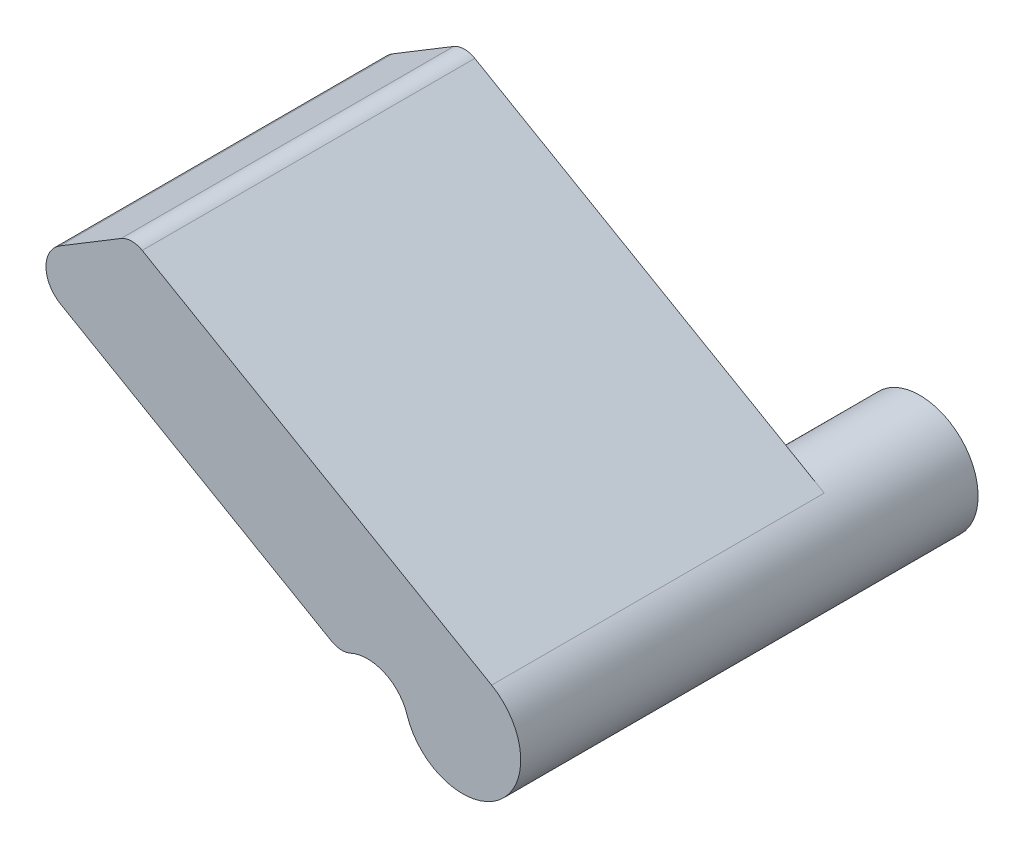
ISO-10303-21;
HEADER;
FILE_DESCRIPTION(('STEP AP214'),'2;1');
FILE_NAME('part.step','',(''),(''),'','','');
FILE_SCHEMA(('AUTOMOTIVE_DESIGN { 1 0 10303 214 1 1 1 1 }'));
ENDSEC;
DATA;
#1=APPLICATION_CONTEXT('core data for automotive mechanical design processes');
#2=APPLICATION_PROTOCOL_DEFINITION('international standard','automotive_design',2000,#1);
#3=PRODUCT_CONTEXT('',#1,'mechanical');
#4=PRODUCT('Part','Part','',(#3));
#5=PRODUCT_RELATED_PRODUCT_CATEGORY('part','',(#4));
#6=PRODUCT_DEFINITION_FORMATION('','',#4);
#7=PRODUCT_DEFINITION_CONTEXT('part definition',#1,'design');
#8=PRODUCT_DEFINITION('design','',#6,#7);
#9=PRODUCT_DEFINITION_SHAPE('','',#8);
#10=(LENGTH_UNIT() NAMED_UNIT(*) SI_UNIT(.MILLI.,.METRE.));
#11=(NAMED_UNIT(*) PLANE_ANGLE_UNIT() SI_UNIT($,.RADIAN.));
#12=(NAMED_UNIT(*) SI_UNIT($,.STERADIAN.) SOLID_ANGLE_UNIT());
#13=UNCERTAINTY_MEASURE_WITH_UNIT(LENGTH_MEASURE(1.E-05),#10,'distance_accuracy_value','');
#14=(GEOMETRIC_REPRESENTATION_CONTEXT(3) GLOBAL_UNCERTAINTY_ASSIGNED_CONTEXT((#13)) GLOBAL_UNIT_ASSIGNED_CONTEXT((#10,
#11,#12)) REPRESENTATION_CONTEXT('',''));
#15=CARTESIAN_POINT('',(0.,0.,0.));
#16=DIRECTION('',(0.,0.,1.));
#17=DIRECTION('',(1.,0.,0.));
#18=AXIS2_PLACEMENT_3D('',#15,#16,#17);
#19=CARTESIAN_POINT('',(-7.96025403784438,6.21243556529823,8.));
#20=DIRECTION('',(0.517785832846385,-0.855510275393333,0.));
#21=DIRECTION('',(0.855510275393333,0.517785832846385,0.));
#22=AXIS2_PLACEMENT_3D('',#19,#20,#21);
#23=PLANE('',#22);
#24=DIRECTION('',(-0.855510275393333,-0.517785832846385,0.));
#25=VECTOR('',#24,1.);
#26=CARTESIAN_POINT('',(-7.96025403784438,6.21243556529823,0.));
#27=LINE('',#26,#25);
#28=CARTESIAN_POINT('',(-8.21314633879446,6.05937597684656,0.));
#29=VERTEX_POINT('',#28);
#30=CARTESIAN_POINT('',(-9.68129055728227,5.17080187227626,0.));
#31=VERTEX_POINT('',#30);
#32=EDGE_CURVE('E167',#29,#31,#27,.T.);
#33=ORIENTED_EDGE('',*,*,#32,.T.);
#34=DIRECTION('',(0.,0.,-1.));
#35=VECTOR('',#34,1.);
#36=CARTESIAN_POINT('',(-9.68129055728227,5.17080187227626,8.));
#37=LINE('',#36,#35);
#38=CARTESIAN_POINT('',(-9.68129055728227,5.17080187227626,8.));
#39=VERTEX_POINT('',#38);
#40=EDGE_CURVE('E52',#31,#39,#37,.F.);
#41=ORIENTED_EDGE('',*,*,#40,.T.);
#42=DIRECTION('',(-0.855510275393333,-0.517785832846385,0.));
#43=VECTOR('',#42,1.);
#44=CARTESIAN_POINT('',(-7.96025403784438,6.21243556529823,8.));
#45=LINE('',#44,#43);
#46=CARTESIAN_POINT('',(-8.21314633879446,6.05937597684656,8.));
#47=VERTEX_POINT('',#46);
#48=EDGE_CURVE('E110',#47,#39,#45,.T.);
#49=ORIENTED_EDGE('',*,*,#48,.F.);
#50=DIRECTION('',(0.,0.,-1.));
#51=VECTOR('',#50,1.);
#52=CARTESIAN_POINT('',(-8.21314633879446,6.05937597684656,8.));
#53=LINE('',#52,#51);
#54=EDGE_CURVE('E130',#47,#29,#53,.T.);
#55=ORIENTED_EDGE('',*,*,#54,.T.);
#56=EDGE_LOOP('',(#33,#41,#49,#55));
#57=FACE_BOUND('',#56,.T.);
#58=ADVANCED_FACE('F35',(#57),#23,.F.);
#59=CARTESIAN_POINT('',(-10.6942286340599,4.55773502691897,8.));
#60=DIRECTION('',(0.500000000000001,0.866025403784438,0.));
#61=DIRECTION('',(-0.866025403784438,0.500000000000001,0.));
#62=AXIS2_PLACEMENT_3D('',#59,#60,#61);
#63=PLANE('',#62);
#64=DIRECTION('',(0.866025403784438,-0.500000000000001,0.));
#65=VECTOR('',#64,1.);
#66=CARTESIAN_POINT('',(-10.6942286340599,4.55773502691897,8.));
#67=LINE('',#66,#65);
#68=CARTESIAN_POINT('',(-9.66884047428981,3.96572689685182,8.));
#69=VERTEX_POINT('',#68);
#70=CARTESIAN_POINT('',(-3.15192630425893,0.203184746498806,8.));
#71=VERTEX_POINT('',#70);
#72=EDGE_CURVE('E174',#69,#71,#67,.T.);
#73=ORIENTED_EDGE('',*,*,#72,.F.);
#74=DIRECTION('',(0.,0.,-1.));
#75=VECTOR('',#74,1.);
#76=CARTESIAN_POINT('',(-9.66884047428981,3.96572689685182,8.));
#77=LINE('',#76,#75);
#78=CARTESIAN_POINT('',(-9.66884047428981,3.96572689685182,0.));
#79=VERTEX_POINT('',#78);
#80=EDGE_CURVE('E148',#69,#79,#77,.T.);
#81=ORIENTED_EDGE('',*,*,#80,.T.);
#82=DIRECTION('',(0.866025403784438,-0.500000000000001,0.));
#83=VECTOR('',#82,1.);
#84=CARTESIAN_POINT('',(-10.6942286340599,4.55773502691897,0.));
#85=LINE('',#84,#83);
#86=CARTESIAN_POINT('',(-3.15192630425893,0.203184746498806,0.));
#87=VERTEX_POINT('',#86);
#88=EDGE_CURVE('E137',#79,#87,#85,.T.);
#89=ORIENTED_EDGE('',*,*,#88,.T.);
#90=DIRECTION('',(0.,0.,-1.));
#91=VECTOR('',#90,1.);
#92=CARTESIAN_POINT('',(-3.15192630425893,0.203184746498806,8.));
#93=LINE('',#92,#91);
#94=EDGE_CURVE('E151',#87,#71,#93,.F.);
#95=ORIENTED_EDGE('',*,*,#94,.T.);
#96=EDGE_LOOP('',(#73,#81,#89,#95));
#97=FACE_BOUND('',#96,.T.);
#98=ADVANCED_FACE('F190',(#97),#63,.F.);
#99=CARTESIAN_POINT('',(-2.2858262526838,-0.731435808900241,8.));
#100=DIRECTION('',(0.,0.,-1.));
#101=DIRECTION('',(-1.,0.,0.));
#102=AXIS2_PLACEMENT_3D('',#99,#100,#101);
#103=CYLINDRICAL_SURFACE('',#102,1.);
#104=CARTESIAN_POINT('',(-2.2858262526838,-0.731435808900241,8.));
#105=DIRECTION('',(0.,0.,-1.));
#106=DIRECTION('',(-1.,0.,0.));
#107=AXIS2_PLACEMENT_3D('',#104,#105,#106);
#108=CIRCLE('',#107,1.);
#109=CARTESIAN_POINT('',(-2.69655962040056,0.180319695960603,8.));
#110=VERTEX_POINT('',#109);
#111=CARTESIAN_POINT('',(-1.33339864739889,-0.426670888525141,8.));
#112=VERTEX_POINT('',#111);
#113=EDGE_CURVE('E172',#110,#112,#108,.T.);
#114=ORIENTED_EDGE('',*,*,#113,.F.);
#115=DIRECTION('',(0.,0.,-1.));
#116=VECTOR('',#115,1.);
#117=CARTESIAN_POINT('',(-2.69655962040056,0.180319695960603,8.));
#118=LINE('',#117,#116);
#119=CARTESIAN_POINT('',(-2.69655962040056,0.180319695960603,0.));
#120=VERTEX_POINT('',#119);
#121=EDGE_CURVE('E154',#110,#120,#118,.T.);
#122=ORIENTED_EDGE('',*,*,#121,.T.);
#123=CARTESIAN_POINT('',(-2.2858262526838,-0.731435808900241,0.));
#124=DIRECTION('',(0.,0.,-1.));
#125=DIRECTION('',(-1.,0.,0.));
#126=AXIS2_PLACEMENT_3D('',#123,#124,#125);
#127=CIRCLE('',#126,1.);
#128=CARTESIAN_POINT('',(-1.33339864739889,-0.426670888525141,0.));
#129=VERTEX_POINT('',#128);
#130=EDGE_CURVE('E111',#120,#129,#127,.T.);
#131=ORIENTED_EDGE('',*,*,#130,.T.);
#132=DIRECTION('',(0.,0.,-1.));
#133=VECTOR('',#132,1.);
#134=CARTESIAN_POINT('',(-1.33339864739889,-0.426670888525141,8.));
#135=LINE('',#134,#133);
#136=EDGE_CURVE('E121',#112,#129,#135,.T.);
#137=ORIENTED_EDGE('',*,*,#136,.F.);
#138=EDGE_LOOP('',(#114,#122,#131,#137));
#139=FACE_BOUND('',#138,.T.);
#140=ADVANCED_FACE('F182',(#139),#103,.F.);
#141=CARTESIAN_POINT('',(0.,0.,8.));
#142=DIRECTION('',(0.,0.,-1.));
#143=DIRECTION('',(-1.,0.,0.));
#144=AXIS2_PLACEMENT_3D('',#141,#142,#143);
#145=CYLINDRICAL_SURFACE('',#144,1.4);
#146=ORIENTED_EDGE('',*,*,#136,.T.);
#147=CARTESIAN_POINT('',(0.,0.,0.));
#148=DIRECTION('',(0.,0.,-1.));
#149=DIRECTION('',(-1.,0.,0.));
#150=AXIS2_PLACEMENT_3D('',#147,#148,#149);
#151=CIRCLE('',#150,1.4);
#152=CARTESIAN_POINT('',(0.700000000000003,1.21243556529822,0.));
#153=VERTEX_POINT('',#152);
#154=EDGE_CURVE('E11',#129,#153,#151,.T.);
#155=ORIENTED_EDGE('',*,*,#154,.T.);
#156=DIRECTION('',(0.,0.,-1.));
#157=VECTOR('',#156,1.);
#158=CARTESIAN_POINT('',(0.700000000000003,1.21243556529822,8.));
#159=LINE('',#158,#157);
#160=CARTESIAN_POINT('',(0.700000000000003,1.21243556529822,8.));
#161=VERTEX_POINT('',#160);
#162=EDGE_CURVE('E115',#161,#153,#159,.T.);
#163=ORIENTED_EDGE('',*,*,#162,.F.);
#164=CARTESIAN_POINT('',(0.,0.,8.));
#165=DIRECTION('',(0.,0.,1.));
#166=DIRECTION('',(1.,0.,0.));
#167=AXIS2_PLACEMENT_3D('',#164,#165,#166);
#168=CIRCLE('',#167,1.4);
#169=EDGE_CURVE('E127',#112,#161,#168,.T.);
#170=ORIENTED_EDGE('',*,*,#169,.F.);
#171=EDGE_LOOP('',(#146,#155,#163,#170));
#172=FACE_BOUND('',#171,.T.);
#173=CARTESIAN_POINT('',(0.,0.,-3.));
#174=DIRECTION('',(0.,0.,-1.));
#175=DIRECTION('',(-1.,0.,0.));
#176=AXIS2_PLACEMENT_3D('',#173,#174,#175);
#177=CIRCLE('',#176,1.4);
#178=CARTESIAN_POINT('',(-1.4,0.,-3.));
#179=VERTEX_POINT('',#178);
#180=EDGE_CURVE('E169',#179,#179,#177,.T.);
#181=ORIENTED_EDGE('',*,*,#180,.F.);
#182=EDGE_LOOP('',(#181));
#183=FACE_BOUND('',#182,.T.);
#184=ADVANCED_FACE('F124',(#172,#183),#145,.T.);
#185=CARTESIAN_POINT('',(0.700000000000003,1.21243556529822,8.));
#186=DIRECTION('',(-0.500000000000001,-0.866025403784438,0.));
#187=DIRECTION('',(0.866025403784438,-0.500000000000001,0.));
#188=AXIS2_PLACEMENT_3D('',#185,#186,#187);
#189=PLANE('',#188);
#190=DIRECTION('',(-0.866025403784438,0.500000000000001,0.));
#191=VECTOR('',#190,1.);
#192=CARTESIAN_POINT('',(0.700000000000003,1.21243556529822,0.));
#193=LINE('',#192,#191);
#194=CARTESIAN_POINT('',(-7.70425342237126,6.06463354104211,0.));
#195=VERTEX_POINT('',#194);
#196=EDGE_CURVE('E102',#153,#195,#193,.T.);
#197=ORIENTED_EDGE('',*,*,#196,.T.);
#198=DIRECTION('',(0.,0.,-1.));
#199=VECTOR('',#198,1.);
#200=CARTESIAN_POINT('',(-7.70425342237126,6.06463354104211,8.));
#201=LINE('',#200,#199);
#202=CARTESIAN_POINT('',(-7.70425342237126,6.06463354104211,8.));
#203=VERTEX_POINT('',#202);
#204=EDGE_CURVE('E161',#195,#203,#201,.F.);
#205=ORIENTED_EDGE('',*,*,#204,.T.);
#206=DIRECTION('',(-0.866025403784438,0.500000000000001,0.));
#207=VECTOR('',#206,1.);
#208=CARTESIAN_POINT('',(0.700000000000003,1.21243556529822,8.));
#209=LINE('',#208,#207);
#210=EDGE_CURVE('E118',#161,#203,#209,.T.);
#211=ORIENTED_EDGE('',*,*,#210,.F.);
#212=ORIENTED_EDGE('',*,*,#162,.T.);
#213=EDGE_LOOP('',(#197,#205,#211,#212));
#214=FACE_BOUND('',#213,.T.);
#215=ADVANCED_FACE('F116',(#214),#189,.F.);
#216=CARTESIAN_POINT('',(-2.2858262526838,-0.731435808900241,8.));
#217=DIRECTION('',(0.,0.,-1.));
#218=DIRECTION('',(-1.,0.,0.));
#219=AXIS2_PLACEMENT_3D('',#216,#217,#218);
#220=PLANE('',#219);
#221=ORIENTED_EDGE('',*,*,#48,.T.);
#222=CARTESIAN_POINT('',(-9.3188404742898,4.57194467950093,8.));
#223=DIRECTION('',(0.,0.,-1.));
#224=DIRECTION('',(-1.,0.,0.));
#225=AXIS2_PLACEMENT_3D('',#222,#223,#224);
#226=CIRCLE('',#225,0.7);
#227=EDGE_CURVE('E44',#39,#69,#226,.F.);
#228=ORIENTED_EDGE('',*,*,#227,.T.);
#229=ORIENTED_EDGE('',*,*,#72,.T.);
#230=CARTESIAN_POINT('',(-2.90192630425893,0.636197448391025,8.));
#231=DIRECTION('',(0.,0.,-1.));
#232=DIRECTION('',(-1.,0.,0.));
#233=AXIS2_PLACEMENT_3D('',#230,#231,#232);
#234=CIRCLE('',#233,0.5);
#235=EDGE_CURVE('E159',#71,#110,#234,.F.);
#236=ORIENTED_EDGE('',*,*,#235,.T.);
#237=ORIENTED_EDGE('',*,*,#113,.T.);
#238=ORIENTED_EDGE('',*,*,#169,.T.);
#239=ORIENTED_EDGE('',*,*,#210,.T.);
#240=CARTESIAN_POINT('',(-7.95425342237126,5.6316208391499,8.));
#241=DIRECTION('',(0.,0.,-1.));
#242=DIRECTION('',(-1.,0.,0.));
#243=AXIS2_PLACEMENT_3D('',#240,#241,#242);
#244=CIRCLE('',#243,0.5);
#245=EDGE_CURVE('E157',#203,#47,#244,.F.);
#246=ORIENTED_EDGE('',*,*,#245,.T.);
#247=EDGE_LOOP('',(#221,#228,#229,#236,#237,#238,#239,#246));
#248=FACE_BOUND('',#247,.T.);
#249=ADVANCED_FACE('F188',(#248),#220,.F.);
#250=CARTESIAN_POINT('',(-2.2858262526838,-0.731435808900241,0.));
#251=DIRECTION('',(0.,0.,-1.));
#252=DIRECTION('',(-1.,0.,0.));
#253=AXIS2_PLACEMENT_3D('',#250,#251,#252);
#254=PLANE('',#253);
#255=ORIENTED_EDGE('',*,*,#154,.F.);
#256=ORIENTED_EDGE('',*,*,#130,.F.);
#257=CARTESIAN_POINT('',(-2.90192630425893,0.636197448391025,0.));
#258=DIRECTION('',(0.,0.,-1.));
#259=DIRECTION('',(-1.,0.,0.));
#260=AXIS2_PLACEMENT_3D('',#257,#258,#259);
#261=CIRCLE('',#260,0.5);
#262=EDGE_CURVE('E132',#120,#87,#261,.T.);
#263=ORIENTED_EDGE('',*,*,#262,.T.);
#264=ORIENTED_EDGE('',*,*,#88,.F.);
#265=CARTESIAN_POINT('',(-9.3188404742898,4.57194467950093,0.));
#266=DIRECTION('',(0.,0.,-1.));
#267=DIRECTION('',(-1.,0.,0.));
#268=AXIS2_PLACEMENT_3D('',#265,#266,#267);
#269=CIRCLE('',#268,0.7);
#270=EDGE_CURVE('E60',#79,#31,#269,.T.);
#271=ORIENTED_EDGE('',*,*,#270,.T.);
#272=ORIENTED_EDGE('',*,*,#32,.F.);
#273=CARTESIAN_POINT('',(-7.95425342237126,5.6316208391499,0.));
#274=DIRECTION('',(0.,0.,-1.));
#275=DIRECTION('',(-1.,0.,0.));
#276=AXIS2_PLACEMENT_3D('',#273,#274,#275);
#277=CIRCLE('',#276,0.5);
#278=EDGE_CURVE('E107',#29,#195,#277,.T.);
#279=ORIENTED_EDGE('',*,*,#278,.T.);
#280=ORIENTED_EDGE('',*,*,#196,.F.);
#281=EDGE_LOOP('',(#255,#256,#263,#264,#271,#272,#279,#280));
#282=FACE_BOUND('',#281,.T.);
#283=ADVANCED_FACE('F104',(#282),#254,.T.);
#284=CARTESIAN_POINT('',(-7.95425342237126,5.6316208391499,8.));
#285=DIRECTION('',(0.,0.,-1.));
#286=DIRECTION('',(-1.,0.,0.));
#287=AXIS2_PLACEMENT_3D('',#284,#285,#286);
#288=CYLINDRICAL_SURFACE('',#287,0.5);
#289=ORIENTED_EDGE('',*,*,#245,.F.);
#290=ORIENTED_EDGE('',*,*,#204,.F.);
#291=ORIENTED_EDGE('',*,*,#278,.F.);
#292=ORIENTED_EDGE('',*,*,#54,.F.);
#293=EDGE_LOOP('',(#289,#290,#291,#292));
#294=FACE_BOUND('',#293,.T.);
#295=ADVANCED_FACE('F200',(#294),#288,.T.);
#296=CARTESIAN_POINT('',(-2.90192630425893,0.636197448391025,8.));
#297=DIRECTION('',(0.,0.,-1.));
#298=DIRECTION('',(-1.,0.,0.));
#299=AXIS2_PLACEMENT_3D('',#296,#297,#298);
#300=CYLINDRICAL_SURFACE('',#299,0.5);
#301=ORIENTED_EDGE('',*,*,#235,.F.);
#302=ORIENTED_EDGE('',*,*,#94,.F.);
#303=ORIENTED_EDGE('',*,*,#262,.F.);
#304=ORIENTED_EDGE('',*,*,#121,.F.);
#305=EDGE_LOOP('',(#301,#302,#303,#304));
#306=FACE_BOUND('',#305,.T.);
#307=ADVANCED_FACE('F202',(#306),#300,.T.);
#308=CARTESIAN_POINT('',(-9.3188404742898,4.57194467950093,8.));
#309=DIRECTION('',(0.,0.,-1.));
#310=DIRECTION('',(-1.,0.,0.));
#311=AXIS2_PLACEMENT_3D('',#308,#309,#310);
#312=CYLINDRICAL_SURFACE('',#311,0.7);
#313=ORIENTED_EDGE('',*,*,#227,.F.);
#314=ORIENTED_EDGE('',*,*,#40,.F.);
#315=ORIENTED_EDGE('',*,*,#270,.F.);
#316=ORIENTED_EDGE('',*,*,#80,.F.);
#317=EDGE_LOOP('',(#313,#314,#315,#316));
#318=FACE_BOUND('',#317,.T.);
#319=ADVANCED_FACE('F37',(#318),#312,.T.);
#320=CARTESIAN_POINT('',(0.,0.,-3.));
#321=DIRECTION('',(0.,0.,-1.));
#322=DIRECTION('',(-1.,0.,0.));
#323=AXIS2_PLACEMENT_3D('',#320,#321,#322);
#324=PLANE('',#323);
#325=ORIENTED_EDGE('',*,*,#180,.T.);
#326=EDGE_LOOP('',(#325));
#327=FACE_BOUND('',#326,.T.);
#328=ADVANCED_FACE('F180',(#327),#324,.T.);
#329=CLOSED_SHELL('',(#58,#98,#140,#184,#215,#249,#283,#295,#307,#319,#328));
#330=MANIFOLD_SOLID_BREP('B2',#329);
#331=ADVANCED_BREP_SHAPE_REPRESENTATION('',(#18,#330),#14);
#332=SHAPE_DEFINITION_REPRESENTATION(#9,#331);
ENDSEC;
END-ISO-10303-21;
